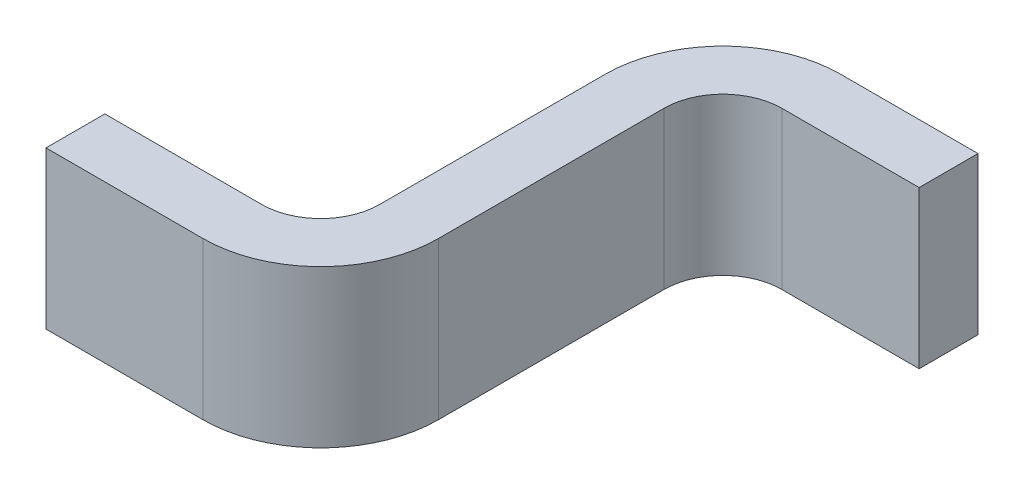
ISO-10303-21;
HEADER;
FILE_DESCRIPTION(('STEP AP214'),'2;1');
FILE_NAME('part.step','',(''),(''),'','','');
FILE_SCHEMA(('AUTOMOTIVE_DESIGN { 1 0 10303 214 1 1 1 1 }'));
ENDSEC;
DATA;
#1=APPLICATION_CONTEXT('core data for automotive mechanical design processes');
#2=APPLICATION_PROTOCOL_DEFINITION('international standard','automotive_design',2000,#1);
#3=PRODUCT_CONTEXT('',#1,'mechanical');
#4=PRODUCT('Part','Part','',(#3));
#5=PRODUCT_RELATED_PRODUCT_CATEGORY('part','',(#4));
#6=PRODUCT_DEFINITION_FORMATION('','',#4);
#7=PRODUCT_DEFINITION_CONTEXT('part definition',#1,'design');
#8=PRODUCT_DEFINITION('design','',#6,#7);
#9=PRODUCT_DEFINITION_SHAPE('','',#8);
#10=(LENGTH_UNIT() NAMED_UNIT(*) SI_UNIT(.MILLI.,.METRE.));
#11=(NAMED_UNIT(*) PLANE_ANGLE_UNIT() SI_UNIT($,.RADIAN.));
#12=(NAMED_UNIT(*) SI_UNIT($,.STERADIAN.) SOLID_ANGLE_UNIT());
#13=UNCERTAINTY_MEASURE_WITH_UNIT(LENGTH_MEASURE(1.E-05),#10,'distance_accuracy_value','');
#14=(GEOMETRIC_REPRESENTATION_CONTEXT(3) GLOBAL_UNCERTAINTY_ASSIGNED_CONTEXT((#13)) GLOBAL_UNIT_ASSIGNED_CONTEXT((#10,
#11,#12)) REPRESENTATION_CONTEXT('',''));
#15=CARTESIAN_POINT('',(0.,0.,0.));
#16=DIRECTION('',(0.,0.,1.));
#17=DIRECTION('',(1.,0.,0.));
#18=AXIS2_PLACEMENT_3D('',#15,#16,#17);
#19=CARTESIAN_POINT('',(3.15,-1.07,0.));
#20=DIRECTION('',(0.,1.,0.));
#21=DIRECTION('',(1.,0.,0.));
#22=AXIS2_PLACEMENT_3D('',#19,#20,#21);
#23=PLANE('',#22);
#24=CARTESIAN_POINT('',(3.05,-1.07,0.3));
#25=DIRECTION('',(0.,-1.,0.));
#26=DIRECTION('',(0.,0.,-1.));
#27=AXIS2_PLACEMENT_3D('',#24,#25,#26);
#28=CIRCLE('',#27,0.15);
#29=CARTESIAN_POINT('',(2.9,-1.07,0.3));
#30=VERTEX_POINT('',#29);
#31=CARTESIAN_POINT('',(3.05,-1.07,0.15));
#32=VERTEX_POINT('',#31);
#33=EDGE_CURVE('E210',#30,#32,#28,.T.);
#34=ORIENTED_EDGE('',*,*,#33,.T.);
#35=DIRECTION('',(-1.,0.,0.));
#36=VECTOR('',#35,1.);
#37=CARTESIAN_POINT('',(0.,-1.07,0.15));
#38=LINE('',#37,#36);
#39=CARTESIAN_POINT('',(3.4,-1.07,0.15));
#40=VERTEX_POINT('',#39);
#41=EDGE_CURVE('E221',#40,#32,#38,.T.);
#42=ORIENTED_EDGE('',*,*,#41,.F.);
#43=DIRECTION('',(0.,0.,1.));
#44=VECTOR('',#43,1.);
#45=CARTESIAN_POINT('',(3.4,-1.07,0.));
#46=LINE('',#45,#44);
#47=CARTESIAN_POINT('',(3.4,-1.07,0.));
#48=VERTEX_POINT('',#47);
#49=EDGE_CURVE('E228',#48,#40,#46,.T.);
#50=ORIENTED_EDGE('',*,*,#49,.F.);
#51=DIRECTION('',(-1.,0.,0.));
#52=VECTOR('',#51,1.);
#53=CARTESIAN_POINT('',(-2.475,-1.07,0.));
#54=LINE('',#53,#52);
#55=CARTESIAN_POINT('',(3.05,-1.07,0.));
#56=VERTEX_POINT('',#55);
#57=EDGE_CURVE('E231',#48,#56,#54,.T.);
#58=ORIENTED_EDGE('',*,*,#57,.T.);
#59=CARTESIAN_POINT('',(3.05,-1.07,0.3));
#60=DIRECTION('',(0.,-1.,0.));
#61=DIRECTION('',(0.,0.,-1.));
#62=AXIS2_PLACEMENT_3D('',#59,#60,#61);
#63=CIRCLE('',#62,0.3);
#64=CARTESIAN_POINT('',(2.75,-1.07,0.3));
#65=VERTEX_POINT('',#64);
#66=EDGE_CURVE('E242',#65,#56,#63,.T.);
#67=ORIENTED_EDGE('',*,*,#66,.F.);
#68=DIRECTION('',(0.,0.,-1.));
#69=VECTOR('',#68,1.);
#70=CARTESIAN_POINT('',(2.75,-1.07,1.175));
#71=LINE('',#70,#69);
#72=CARTESIAN_POINT('',(2.75,-1.07,0.875));
#73=VERTEX_POINT('',#72);
#74=EDGE_CURVE('E249',#73,#65,#71,.T.);
#75=ORIENTED_EDGE('',*,*,#74,.F.);
#76=CARTESIAN_POINT('',(2.6,-1.07,0.875));
#77=DIRECTION('',(0.,-1.,0.));
#78=DIRECTION('',(0.,0.,1.));
#79=AXIS2_PLACEMENT_3D('',#76,#77,#78);
#80=CIRCLE('',#79,0.15);
#81=CARTESIAN_POINT('',(2.6,-1.07,1.025));
#82=VERTEX_POINT('',#81);
#83=EDGE_CURVE('E252',#73,#82,#80,.T.);
#84=ORIENTED_EDGE('',*,*,#83,.T.);
#85=DIRECTION('',(-1.,0.,0.));
#86=VECTOR('',#85,1.);
#87=CARTESIAN_POINT('',(0.,-1.07,1.025));
#88=LINE('',#87,#86);
#89=CARTESIAN_POINT('',(2.2,-1.07,1.025));
#90=VERTEX_POINT('',#89);
#91=EDGE_CURVE('E141',#82,#90,#88,.T.);
#92=ORIENTED_EDGE('',*,*,#91,.T.);
#93=DIRECTION('',(0.,0.,-1.));
#94=VECTOR('',#93,1.);
#95=CARTESIAN_POINT('',(2.2,-1.07,1.1));
#96=LINE('',#95,#94);
#97=CARTESIAN_POINT('',(2.2,-1.07,1.175));
#98=VERTEX_POINT('',#97);
#99=EDGE_CURVE('E25',#98,#90,#96,.T.);
#100=ORIENTED_EDGE('',*,*,#99,.F.);
#101=DIRECTION('',(-1.,0.,0.));
#102=VECTOR('',#101,1.);
#103=CARTESIAN_POINT('',(0.,-1.07,1.175));
#104=LINE('',#103,#102);
#105=CARTESIAN_POINT('',(2.6,-1.07,1.175));
#106=VERTEX_POINT('',#105);
#107=EDGE_CURVE('E11',#106,#98,#104,.T.);
#108=ORIENTED_EDGE('',*,*,#107,.F.);
#109=CARTESIAN_POINT('',(2.6,-1.07,0.875));
#110=DIRECTION('',(0.,-1.,0.));
#111=DIRECTION('',(0.,0.,-1.));
#112=AXIS2_PLACEMENT_3D('',#109,#110,#111);
#113=CIRCLE('',#112,0.3);
#114=CARTESIAN_POINT('',(2.9,-1.07,0.875));
#115=VERTEX_POINT('',#114);
#116=EDGE_CURVE('E172',#115,#106,#113,.T.);
#117=ORIENTED_EDGE('',*,*,#116,.F.);
#118=DIRECTION('',(0.,0.,1.));
#119=VECTOR('',#118,1.);
#120=CARTESIAN_POINT('',(2.9,-1.07,1.175));
#121=LINE('',#120,#119);
#122=EDGE_CURVE('E185',#30,#115,#121,.T.);
#123=ORIENTED_EDGE('',*,*,#122,.F.);
#124=EDGE_LOOP('',(#34,#42,#50,#58,#67,#75,#84,#92,#100,#108,#117,#123));
#125=FACE_BOUND('',#124,.T.);
#126=ADVANCED_FACE('F17',(#125),#23,.T.);
#127=CARTESIAN_POINT('',(0.,0.,1.175));
#128=DIRECTION('',(0.,0.,1.));
#129=DIRECTION('',(1.,0.,0.));
#130=AXIS2_PLACEMENT_3D('',#127,#128,#129);
#131=PLANE('',#130);
#132=DIRECTION('',(0.,1.,0.));
#133=VECTOR('',#132,1.);
#134=CARTESIAN_POINT('',(2.2,-1.27,1.175));
#135=LINE('',#134,#133);
#136=CARTESIAN_POINT('',(2.2,-1.47,1.175));
#137=VERTEX_POINT('',#136);
#138=EDGE_CURVE('E134',#137,#98,#135,.T.);
#139=ORIENTED_EDGE('',*,*,#138,.F.);
#140=DIRECTION('',(-1.,0.,0.));
#141=VECTOR('',#140,1.);
#142=CARTESIAN_POINT('',(2.825,-1.47,1.175));
#143=LINE('',#142,#141);
#144=CARTESIAN_POINT('',(2.6,-1.47,1.175));
#145=VERTEX_POINT('',#144);
#146=EDGE_CURVE('E138',#145,#137,#143,.T.);
#147=ORIENTED_EDGE('',*,*,#146,.F.);
#148=DIRECTION('',(0.,1.,0.));
#149=VECTOR('',#148,1.);
#150=CARTESIAN_POINT('',(2.6,0.,1.175));
#151=LINE('',#150,#149);
#152=EDGE_CURVE('E186',#145,#106,#151,.T.);
#153=ORIENTED_EDGE('',*,*,#152,.T.);
#154=ORIENTED_EDGE('',*,*,#107,.T.);
#155=EDGE_LOOP('',(#139,#147,#153,#154));
#156=FACE_BOUND('',#155,.T.);
#157=ADVANCED_FACE('F136',(#156),#131,.T.);
#158=CARTESIAN_POINT('',(2.2,-1.27,1.1));
#159=DIRECTION('',(-1.,0.,0.));
#160=DIRECTION('',(0.,0.,1.));
#161=AXIS2_PLACEMENT_3D('',#158,#159,#160);
#162=PLANE('',#161);
#163=ORIENTED_EDGE('',*,*,#138,.T.);
#164=ORIENTED_EDGE('',*,*,#99,.T.);
#165=DIRECTION('',(0.,-1.,0.));
#166=VECTOR('',#165,1.);
#167=CARTESIAN_POINT('',(2.2,0.,1.025));
#168=LINE('',#167,#166);
#169=CARTESIAN_POINT('',(2.2,-1.47,1.025));
#170=VERTEX_POINT('',#169);
#171=EDGE_CURVE('E147',#90,#170,#168,.T.);
#172=ORIENTED_EDGE('',*,*,#171,.T.);
#173=DIRECTION('',(0.,0.,-1.));
#174=VECTOR('',#173,1.);
#175=CARTESIAN_POINT('',(2.2,-1.47,1.175));
#176=LINE('',#175,#174);
#177=EDGE_CURVE('E144',#137,#170,#176,.T.);
#178=ORIENTED_EDGE('',*,*,#177,.F.);
#179=EDGE_LOOP('',(#163,#164,#172,#178));
#180=FACE_BOUND('',#179,.T.);
#181=ADVANCED_FACE('F145',(#180),#162,.T.);
#182=CARTESIAN_POINT('',(0.,0.,1.025));
#183=DIRECTION('',(0.,0.,1.));
#184=DIRECTION('',(1.,0.,0.));
#185=AXIS2_PLACEMENT_3D('',#182,#183,#184);
#186=PLANE('',#185);
#187=DIRECTION('',(1.,0.,0.));
#188=VECTOR('',#187,1.);
#189=CARTESIAN_POINT('',(2.825,-1.47,1.025));
#190=LINE('',#189,#188);
#191=CARTESIAN_POINT('',(2.6,-1.47,1.025));
#192=VERTEX_POINT('',#191);
#193=EDGE_CURVE('E152',#170,#192,#190,.T.);
#194=ORIENTED_EDGE('',*,*,#193,.F.);
#195=ORIENTED_EDGE('',*,*,#171,.F.);
#196=ORIENTED_EDGE('',*,*,#91,.F.);
#197=DIRECTION('',(0.,-1.,0.));
#198=VECTOR('',#197,1.);
#199=CARTESIAN_POINT('',(2.6,-0.635,1.025));
#200=LINE('',#199,#198);
#201=EDGE_CURVE('E256',#82,#192,#200,.T.);
#202=ORIENTED_EDGE('',*,*,#201,.T.);
#203=EDGE_LOOP('',(#194,#195,#196,#202));
#204=FACE_BOUND('',#203,.T.);
#205=ADVANCED_FACE('F461',(#204),#186,.F.);
#206=CARTESIAN_POINT('',(2.6,-0.635,0.875));
#207=DIRECTION('',(0.,1.,0.));
#208=DIRECTION('',(0.,0.,1.));
#209=AXIS2_PLACEMENT_3D('',#206,#207,#208);
#210=CYLINDRICAL_SURFACE('',#209,0.15);
#211=ORIENTED_EDGE('',*,*,#83,.F.);
#212=DIRECTION('',(0.,1.,0.));
#213=VECTOR('',#212,1.);
#214=CARTESIAN_POINT('',(2.75,-1.27,0.875));
#215=LINE('',#214,#213);
#216=CARTESIAN_POINT('',(2.75,-1.47,0.875));
#217=VERTEX_POINT('',#216);
#218=EDGE_CURVE('E245',#217,#73,#215,.T.);
#219=ORIENTED_EDGE('',*,*,#218,.F.);
#220=CARTESIAN_POINT('',(2.6,-1.47,0.875));
#221=DIRECTION('',(0.,1.,0.));
#222=DIRECTION('',(0.,0.,1.));
#223=AXIS2_PLACEMENT_3D('',#220,#221,#222);
#224=CIRCLE('',#223,0.15);
#225=EDGE_CURVE('E174',#192,#217,#224,.T.);
#226=ORIENTED_EDGE('',*,*,#225,.F.);
#227=ORIENTED_EDGE('',*,*,#201,.F.);
#228=EDGE_LOOP('',(#211,#219,#226,#227));
#229=FACE_BOUND('',#228,.T.);
#230=ADVANCED_FACE('F455',(#229),#210,.F.);
#231=CARTESIAN_POINT('',(2.75,-1.27,1.175));
#232=DIRECTION('',(-1.,0.,0.));
#233=DIRECTION('',(0.,0.,1.));
#234=AXIS2_PLACEMENT_3D('',#231,#232,#233);
#235=PLANE('',#234);
#236=ORIENTED_EDGE('',*,*,#218,.T.);
#237=ORIENTED_EDGE('',*,*,#74,.T.);
#238=DIRECTION('',(0.,1.,0.));
#239=VECTOR('',#238,1.);
#240=CARTESIAN_POINT('',(2.75,0.,0.3));
#241=LINE('',#240,#239);
#242=CARTESIAN_POINT('',(2.75,-1.47,0.3));
#243=VERTEX_POINT('',#242);
#244=EDGE_CURVE('E238',#243,#65,#241,.T.);
#245=ORIENTED_EDGE('',*,*,#244,.F.);
#246=DIRECTION('',(0.,0.,-1.));
#247=VECTOR('',#246,1.);
#248=CARTESIAN_POINT('',(2.75,-1.47,1.175));
#249=LINE('',#248,#247);
#250=EDGE_CURVE('E178',#217,#243,#249,.T.);
#251=ORIENTED_EDGE('',*,*,#250,.F.);
#252=EDGE_LOOP('',(#236,#237,#245,#251));
#253=FACE_BOUND('',#252,.T.);
#254=ADVANCED_FACE('F460',(#253),#235,.T.);
#255=CARTESIAN_POINT('',(3.05,0.,0.3));
#256=DIRECTION('',(0.,-1.,0.));
#257=DIRECTION('',(0.,0.,-1.));
#258=AXIS2_PLACEMENT_3D('',#255,#256,#257);
#259=CYLINDRICAL_SURFACE('',#258,0.3);
#260=DIRECTION('',(0.,-1.,0.));
#261=VECTOR('',#260,1.);
#262=CARTESIAN_POINT('',(3.05,1.27,0.));
#263=LINE('',#262,#261);
#264=CARTESIAN_POINT('',(3.05,-1.47,0.));
#265=VERTEX_POINT('',#264);
#266=EDGE_CURVE('E235',#56,#265,#263,.T.);
#267=ORIENTED_EDGE('',*,*,#266,.T.);
#268=CARTESIAN_POINT('',(3.05,-1.47,0.3));
#269=DIRECTION('',(0.,-1.,0.));
#270=DIRECTION('',(0.,0.,-1.));
#271=AXIS2_PLACEMENT_3D('',#268,#269,#270);
#272=CIRCLE('',#271,0.3);
#273=EDGE_CURVE('E193',#243,#265,#272,.T.);
#274=ORIENTED_EDGE('',*,*,#273,.F.);
#275=ORIENTED_EDGE('',*,*,#244,.T.);
#276=ORIENTED_EDGE('',*,*,#66,.T.);
#277=EDGE_LOOP('',(#267,#274,#275,#276));
#278=FACE_BOUND('',#277,.T.);
#279=ADVANCED_FACE('F555',(#278),#259,.T.);
#280=CARTESIAN_POINT('',(-2.475,1.27,0.));
#281=DIRECTION('',(0.,0.,1.));
#282=DIRECTION('',(1.,0.,0.));
#283=AXIS2_PLACEMENT_3D('',#280,#281,#282);
#284=PLANE('',#283);
#285=ORIENTED_EDGE('',*,*,#57,.F.);
#286=DIRECTION('',(0.,1.,0.));
#287=VECTOR('',#286,1.);
#288=CARTESIAN_POINT('',(3.4,-1.27,0.));
#289=LINE('',#288,#287);
#290=CARTESIAN_POINT('',(3.4,-1.47,0.));
#291=VERTEX_POINT('',#290);
#292=EDGE_CURVE('E224',#291,#48,#289,.T.);
#293=ORIENTED_EDGE('',*,*,#292,.F.);
#294=DIRECTION('',(1.,0.,0.));
#295=VECTOR('',#294,1.);
#296=CARTESIAN_POINT('',(2.825,-1.47,0.));
#297=LINE('',#296,#295);
#298=EDGE_CURVE('E194',#265,#291,#297,.T.);
#299=ORIENTED_EDGE('',*,*,#298,.F.);
#300=ORIENTED_EDGE('',*,*,#266,.F.);
#301=EDGE_LOOP('',(#285,#293,#299,#300));
#302=FACE_BOUND('',#301,.T.);
#303=ADVANCED_FACE('F543',(#302),#284,.F.);
#304=CARTESIAN_POINT('',(3.4,-1.27,0.));
#305=DIRECTION('',(1.,0.,0.));
#306=DIRECTION('',(0.,1.,0.));
#307=AXIS2_PLACEMENT_3D('',#304,#305,#306);
#308=PLANE('',#307);
#309=ORIENTED_EDGE('',*,*,#292,.T.);
#310=ORIENTED_EDGE('',*,*,#49,.T.);
#311=DIRECTION('',(0.,1.,0.));
#312=VECTOR('',#311,1.);
#313=CARTESIAN_POINT('',(3.4,0.,0.15));
#314=LINE('',#313,#312);
#315=CARTESIAN_POINT('',(3.4,-1.47,0.15));
#316=VERTEX_POINT('',#315);
#317=EDGE_CURVE('E217',#316,#40,#314,.T.);
#318=ORIENTED_EDGE('',*,*,#317,.F.);
#319=DIRECTION('',(0.,0.,1.));
#320=VECTOR('',#319,1.);
#321=CARTESIAN_POINT('',(3.4,-1.47,1.175));
#322=LINE('',#321,#320);
#323=EDGE_CURVE('E198',#291,#316,#322,.T.);
#324=ORIENTED_EDGE('',*,*,#323,.F.);
#325=EDGE_LOOP('',(#309,#310,#318,#324));
#326=FACE_BOUND('',#325,.T.);
#327=ADVANCED_FACE('F521',(#326),#308,.T.);
#328=CARTESIAN_POINT('',(0.,0.,0.15));
#329=DIRECTION('',(0.,0.,1.));
#330=DIRECTION('',(1.,0.,0.));
#331=AXIS2_PLACEMENT_3D('',#328,#329,#330);
#332=PLANE('',#331);
#333=ORIENTED_EDGE('',*,*,#317,.T.);
#334=ORIENTED_EDGE('',*,*,#41,.T.);
#335=DIRECTION('',(0.,-1.,0.));
#336=VECTOR('',#335,1.);
#337=CARTESIAN_POINT('',(3.05,-0.635,0.15));
#338=LINE('',#337,#336);
#339=CARTESIAN_POINT('',(3.05,-1.47,0.15));
#340=VERTEX_POINT('',#339);
#341=EDGE_CURVE('E214',#32,#340,#338,.T.);
#342=ORIENTED_EDGE('',*,*,#341,.T.);
#343=DIRECTION('',(-1.,0.,0.));
#344=VECTOR('',#343,1.);
#345=CARTESIAN_POINT('',(2.825,-1.47,0.15));
#346=LINE('',#345,#344);
#347=EDGE_CURVE('E205',#316,#340,#346,.T.);
#348=ORIENTED_EDGE('',*,*,#347,.F.);
#349=EDGE_LOOP('',(#333,#334,#342,#348));
#350=FACE_BOUND('',#349,.T.);
#351=ADVANCED_FACE('F509',(#350),#332,.T.);
#352=CARTESIAN_POINT('',(3.05,-0.635,0.3));
#353=DIRECTION('',(0.,-1.,0.));
#354=DIRECTION('',(0.,0.,-1.));
#355=AXIS2_PLACEMENT_3D('',#352,#353,#354);
#356=CYLINDRICAL_SURFACE('',#355,0.15);
#357=ORIENTED_EDGE('',*,*,#33,.F.);
#358=DIRECTION('',(0.,1.,0.));
#359=VECTOR('',#358,1.);
#360=CARTESIAN_POINT('',(2.9,-1.27,0.3));
#361=LINE('',#360,#359);
#362=CARTESIAN_POINT('',(2.9,-1.47,0.3));
#363=VERTEX_POINT('',#362);
#364=EDGE_CURVE('E181',#363,#30,#361,.T.);
#365=ORIENTED_EDGE('',*,*,#364,.F.);
#366=CARTESIAN_POINT('',(3.05,-1.47,0.3));
#367=DIRECTION('',(0.,1.,0.));
#368=DIRECTION('',(0.,0.,-1.));
#369=AXIS2_PLACEMENT_3D('',#366,#367,#368);
#370=CIRCLE('',#369,0.15);
#371=EDGE_CURVE('E173',#340,#363,#370,.T.);
#372=ORIENTED_EDGE('',*,*,#371,.F.);
#373=ORIENTED_EDGE('',*,*,#341,.F.);
#374=EDGE_LOOP('',(#357,#365,#372,#373));
#375=FACE_BOUND('',#374,.T.);
#376=ADVANCED_FACE('F497',(#375),#356,.F.);
#377=CARTESIAN_POINT('',(2.9,-1.27,1.175));
#378=DIRECTION('',(1.,0.,0.));
#379=DIRECTION('',(0.,1.,0.));
#380=AXIS2_PLACEMENT_3D('',#377,#378,#379);
#381=PLANE('',#380);
#382=DIRECTION('',(0.,1.,0.));
#383=VECTOR('',#382,1.);
#384=CARTESIAN_POINT('',(2.9,-0.635,0.875));
#385=LINE('',#384,#383);
#386=CARTESIAN_POINT('',(2.9,-1.47,0.875));
#387=VERTEX_POINT('',#386);
#388=EDGE_CURVE('E168',#387,#115,#385,.T.);
#389=ORIENTED_EDGE('',*,*,#388,.F.);
#390=DIRECTION('',(0.,0.,1.));
#391=VECTOR('',#390,1.);
#392=CARTESIAN_POINT('',(2.9,-1.47,1.175));
#393=LINE('',#392,#391);
#394=EDGE_CURVE('E164',#363,#387,#393,.T.);
#395=ORIENTED_EDGE('',*,*,#394,.F.);
#396=ORIENTED_EDGE('',*,*,#364,.T.);
#397=ORIENTED_EDGE('',*,*,#122,.T.);
#398=EDGE_LOOP('',(#389,#395,#396,#397));
#399=FACE_BOUND('',#398,.T.);
#400=ADVANCED_FACE('F485',(#399),#381,.T.);
#401=CARTESIAN_POINT('',(2.6,-0.635,0.875));
#402=DIRECTION('',(0.,-1.,0.));
#403=DIRECTION('',(0.,0.,-1.));
#404=AXIS2_PLACEMENT_3D('',#401,#402,#403);
#405=CYLINDRICAL_SURFACE('',#404,0.3);
#406=ORIENTED_EDGE('',*,*,#388,.T.);
#407=ORIENTED_EDGE('',*,*,#116,.T.);
#408=ORIENTED_EDGE('',*,*,#152,.F.);
#409=CARTESIAN_POINT('',(2.6,-1.47,0.875));
#410=DIRECTION('',(0.,-1.,0.));
#411=DIRECTION('',(0.,0.,-1.));
#412=AXIS2_PLACEMENT_3D('',#409,#410,#411);
#413=CIRCLE('',#412,0.3);
#414=EDGE_CURVE('E157',#387,#145,#413,.T.);
#415=ORIENTED_EDGE('',*,*,#414,.F.);
#416=EDGE_LOOP('',(#406,#407,#408,#415));
#417=FACE_BOUND('',#416,.T.);
#418=ADVANCED_FACE('F474',(#417),#405,.T.);
#419=CARTESIAN_POINT('',(2.825,-1.47,1.175));
#420=DIRECTION('',(0.,-1.,0.));
#421=DIRECTION('',(0.,0.,-1.));
#422=AXIS2_PLACEMENT_3D('',#419,#420,#421);
#423=PLANE('',#422);
#424=ORIENTED_EDGE('',*,*,#394,.T.);
#425=ORIENTED_EDGE('',*,*,#414,.T.);
#426=ORIENTED_EDGE('',*,*,#146,.T.);
#427=ORIENTED_EDGE('',*,*,#177,.T.);
#428=ORIENTED_EDGE('',*,*,#193,.T.);
#429=ORIENTED_EDGE('',*,*,#225,.T.);
#430=ORIENTED_EDGE('',*,*,#250,.T.);
#431=ORIENTED_EDGE('',*,*,#273,.T.);
#432=ORIENTED_EDGE('',*,*,#298,.T.);
#433=ORIENTED_EDGE('',*,*,#323,.T.);
#434=ORIENTED_EDGE('',*,*,#347,.T.);
#435=ORIENTED_EDGE('',*,*,#371,.T.);
#436=EDGE_LOOP('',(#424,#425,#426,#427,#428,#429,#430,#431,#432,#433,#434,#435));
#437=FACE_BOUND('',#436,.T.);
#438=ADVANCED_FACE('F155',(#437),#423,.T.);
#439=CLOSED_SHELL('',(#126,#157,#181,#205,#230,#254,#279,#303,#327,#351,#376,#400,#418,#438));
#440=MANIFOLD_SOLID_BREP('B1',#439);
#441=ADVANCED_BREP_SHAPE_REPRESENTATION('',(#18,#440),#14);
#442=SHAPE_DEFINITION_REPRESENTATION(#9,#441);
ENDSEC;
END-ISO-10303-21;
